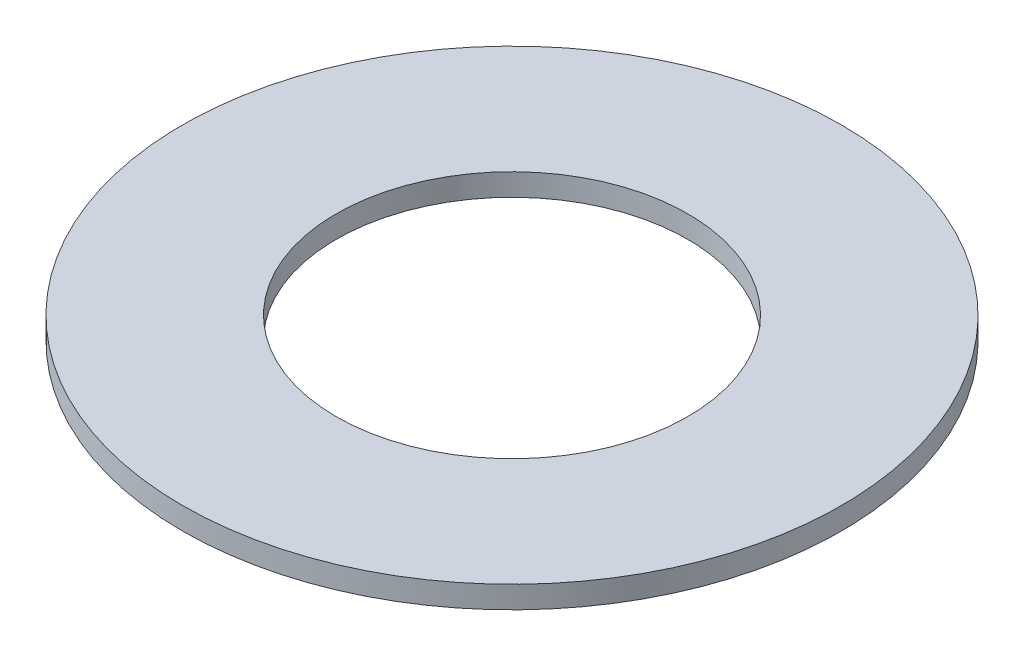
ISO-10303-21;
HEADER;
FILE_DESCRIPTION(('STEP AP214'),'2;1');
FILE_NAME('part.step','',(''),(''),'','','');
FILE_SCHEMA(('AUTOMOTIVE_DESIGN { 1 0 10303 214 1 1 1 1 }'));
ENDSEC;
DATA;
#1=APPLICATION_CONTEXT('core data for automotive mechanical design processes');
#2=APPLICATION_PROTOCOL_DEFINITION('international standard','automotive_design',2000,#1);
#3=PRODUCT_CONTEXT('',#1,'mechanical');
#4=PRODUCT('Part','Part','',(#3));
#5=PRODUCT_RELATED_PRODUCT_CATEGORY('part','',(#4));
#6=PRODUCT_DEFINITION_FORMATION('','',#4);
#7=PRODUCT_DEFINITION_CONTEXT('part definition',#1,'design');
#8=PRODUCT_DEFINITION('design','',#6,#7);
#9=PRODUCT_DEFINITION_SHAPE('','',#8);
#10=(LENGTH_UNIT() NAMED_UNIT(*) SI_UNIT(.MILLI.,.METRE.));
#11=(NAMED_UNIT(*) PLANE_ANGLE_UNIT() SI_UNIT($,.RADIAN.));
#12=(NAMED_UNIT(*) SI_UNIT($,.STERADIAN.) SOLID_ANGLE_UNIT());
#13=UNCERTAINTY_MEASURE_WITH_UNIT(LENGTH_MEASURE(1.E-05),#10,'distance_accuracy_value','');
#14=(GEOMETRIC_REPRESENTATION_CONTEXT(3) GLOBAL_UNCERTAINTY_ASSIGNED_CONTEXT((#13)) GLOBAL_UNIT_ASSIGNED_CONTEXT((#10,
#11,#12)) REPRESENTATION_CONTEXT('',''));
#15=CARTESIAN_POINT('',(0.,0.,0.));
#16=DIRECTION('',(0.,0.,1.));
#17=DIRECTION('',(1.,0.,0.));
#18=AXIS2_PLACEMENT_3D('',#15,#16,#17);
#19=CARTESIAN_POINT('',(0.,0.8001,0.));
#20=DIRECTION('',(0.,1.,0.));
#21=DIRECTION('',(0.,0.,1.));
#22=AXIS2_PLACEMENT_3D('',#19,#20,#21);
#23=PLANE('',#22);
#24=CARTESIAN_POINT('',(0.,0.8001,0.));
#25=DIRECTION('',(0.,1.,0.));
#26=DIRECTION('',(0.,0.,1.));
#27=AXIS2_PLACEMENT_3D('',#24,#25,#26);
#28=CIRCLE('',#27,11.90625);
#29=CARTESIAN_POINT('',(0.,0.8001,11.90625));
#30=VERTEX_POINT('',#29);
#31=EDGE_CURVE('E10',#30,#30,#28,.T.);
#32=ORIENTED_EDGE('',*,*,#31,.T.);
#33=EDGE_LOOP('',(#32));
#34=FACE_BOUND('',#33,.T.);
#35=CARTESIAN_POINT('',(0.,0.8001,0.));
#36=DIRECTION('',(0.,1.,0.));
#37=DIRECTION('',(0.,0.,1.));
#38=AXIS2_PLACEMENT_3D('',#35,#36,#37);
#39=CIRCLE('',#38,6.35);
#40=CARTESIAN_POINT('',(0.,0.8001,6.35));
#41=VERTEX_POINT('',#40);
#42=EDGE_CURVE('E42',#41,#41,#39,.T.);
#43=ORIENTED_EDGE('',*,*,#42,.F.);
#44=EDGE_LOOP('',(#43));
#45=FACE_BOUND('',#44,.T.);
#46=ADVANCED_FACE('F31',(#34,#45),#23,.T.);
#47=CARTESIAN_POINT('',(0.,0.,0.));
#48=DIRECTION('',(0.,1.,0.));
#49=DIRECTION('',(0.,0.,1.));
#50=AXIS2_PLACEMENT_3D('',#47,#48,#49);
#51=PLANE('',#50);
#52=CARTESIAN_POINT('',(0.,0.,0.));
#53=DIRECTION('',(0.,1.,0.));
#54=DIRECTION('',(0.,0.,1.));
#55=AXIS2_PLACEMENT_3D('',#52,#53,#54);
#56=CIRCLE('',#55,11.90625);
#57=CARTESIAN_POINT('',(0.,0.,11.90625));
#58=VERTEX_POINT('',#57);
#59=EDGE_CURVE('E35',#58,#58,#56,.T.);
#60=ORIENTED_EDGE('',*,*,#59,.F.);
#61=EDGE_LOOP('',(#60));
#62=FACE_BOUND('',#61,.T.);
#63=CARTESIAN_POINT('',(0.,0.,0.));
#64=DIRECTION('',(0.,1.,0.));
#65=DIRECTION('',(0.,0.,1.));
#66=AXIS2_PLACEMENT_3D('',#63,#64,#65);
#67=CIRCLE('',#66,6.35);
#68=CARTESIAN_POINT('',(0.,0.,6.35));
#69=VERTEX_POINT('',#68);
#70=EDGE_CURVE('E44',#69,#69,#67,.T.);
#71=ORIENTED_EDGE('',*,*,#70,.T.);
#72=EDGE_LOOP('',(#71));
#73=FACE_BOUND('',#72,.T.);
#74=ADVANCED_FACE('F54',(#62,#73),#51,.F.);
#75=CARTESIAN_POINT('',(0.,0.8001,0.));
#76=DIRECTION('',(0.,-1.,0.));
#77=DIRECTION('',(0.,0.,-1.));
#78=AXIS2_PLACEMENT_3D('',#75,#76,#77);
#79=CYLINDRICAL_SURFACE('',#78,11.90625);
#80=ORIENTED_EDGE('',*,*,#31,.F.);
#81=EDGE_LOOP('',(#80));
#82=FACE_BOUND('',#81,.T.);
#83=ORIENTED_EDGE('',*,*,#59,.T.);
#84=EDGE_LOOP('',(#83));
#85=FACE_BOUND('',#84,.T.);
#86=ADVANCED_FACE('F33',(#82,#85),#79,.T.);
#87=CARTESIAN_POINT('',(0.,0.8001,0.));
#88=DIRECTION('',(0.,-1.,0.));
#89=DIRECTION('',(0.,0.,-1.));
#90=AXIS2_PLACEMENT_3D('',#87,#88,#89);
#91=CYLINDRICAL_SURFACE('',#90,6.35);
#92=ORIENTED_EDGE('',*,*,#42,.T.);
#93=EDGE_LOOP('',(#92));
#94=FACE_BOUND('',#93,.T.);
#95=ORIENTED_EDGE('',*,*,#70,.F.);
#96=EDGE_LOOP('',(#95));
#97=FACE_BOUND('',#96,.T.);
#98=ADVANCED_FACE('F50',(#94,#97),#91,.F.);
#99=CLOSED_SHELL('',(#46,#74,#86,#98));
#100=MANIFOLD_SOLID_BREP('B2',#99);
#101=ADVANCED_BREP_SHAPE_REPRESENTATION('',(#18,#100),#14);
#102=SHAPE_DEFINITION_REPRESENTATION(#9,#101);
ENDSEC;
END-ISO-10303-21;
